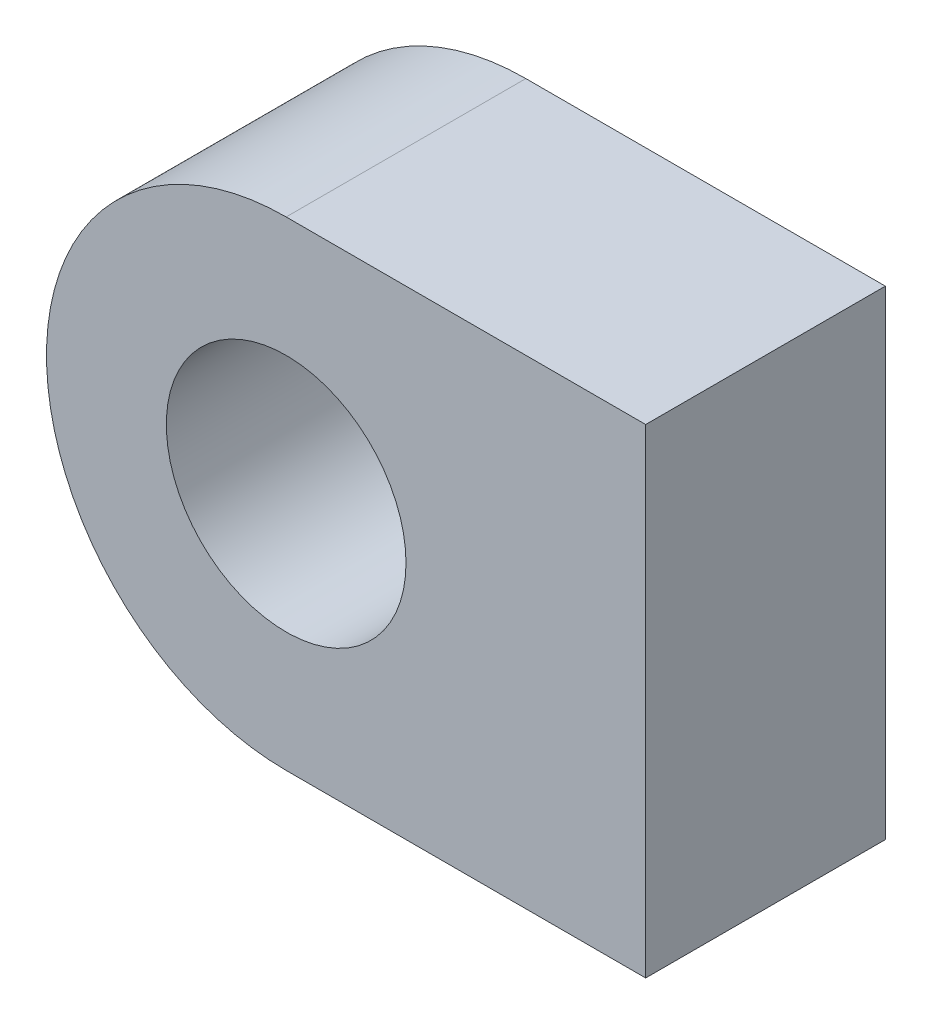
ISO-10303-21;
HEADER;
FILE_DESCRIPTION(('STEP AP214'),'2;1');
FILE_NAME('part.step','',(''),(''),'','','');
FILE_SCHEMA(('AUTOMOTIVE_DESIGN { 1 0 10303 214 1 1 1 1 }'));
ENDSEC;
DATA;
#1=APPLICATION_CONTEXT('core data for automotive mechanical design processes');
#2=APPLICATION_PROTOCOL_DEFINITION('international standard','automotive_design',2000,#1);
#3=PRODUCT_CONTEXT('',#1,'mechanical');
#4=PRODUCT('Part','Part','',(#3));
#5=PRODUCT_RELATED_PRODUCT_CATEGORY('part','',(#4));
#6=PRODUCT_DEFINITION_FORMATION('','',#4);
#7=PRODUCT_DEFINITION_CONTEXT('part definition',#1,'design');
#8=PRODUCT_DEFINITION('design','',#6,#7);
#9=PRODUCT_DEFINITION_SHAPE('','',#8);
#10=(LENGTH_UNIT() NAMED_UNIT(*) SI_UNIT(.MILLI.,.METRE.));
#11=(NAMED_UNIT(*) PLANE_ANGLE_UNIT() SI_UNIT($,.RADIAN.));
#12=(NAMED_UNIT(*) SI_UNIT($,.STERADIAN.) SOLID_ANGLE_UNIT());
#13=UNCERTAINTY_MEASURE_WITH_UNIT(LENGTH_MEASURE(1.E-05),#10,'distance_accuracy_value','');
#14=(GEOMETRIC_REPRESENTATION_CONTEXT(3) GLOBAL_UNCERTAINTY_ASSIGNED_CONTEXT((#13)) GLOBAL_UNIT_ASSIGNED_CONTEXT((#10,
#11,#12)) REPRESENTATION_CONTEXT('',''));
#15=CARTESIAN_POINT('',(0.,0.,0.));
#16=DIRECTION('',(0.,0.,1.));
#17=DIRECTION('',(1.,0.,0.));
#18=AXIS2_PLACEMENT_3D('',#15,#16,#17);
#19=CARTESIAN_POINT('',(0.,10.,-10.));
#20=DIRECTION('',(0.,1.,0.));
#21=DIRECTION('',(-1.,0.,0.));
#22=AXIS2_PLACEMENT_3D('',#19,#20,#21);
#23=PLANE('',#22);
#24=DIRECTION('',(-1.,0.,0.));
#25=VECTOR('',#24,1.);
#26=CARTESIAN_POINT('',(0.,10.,0.));
#27=LINE('',#26,#25);
#28=CARTESIAN_POINT('',(0.,10.,0.));
#29=VERTEX_POINT('',#28);
#30=CARTESIAN_POINT('',(-15.,10.,0.));
#31=VERTEX_POINT('',#30);
#32=EDGE_CURVE('E110',#29,#31,#27,.T.);
#33=ORIENTED_EDGE('',*,*,#32,.F.);
#34=DIRECTION('',(0.,0.,1.));
#35=VECTOR('',#34,1.);
#36=CARTESIAN_POINT('',(0.,10.,-10.));
#37=LINE('',#36,#35);
#38=CARTESIAN_POINT('',(0.,10.,-10.));
#39=VERTEX_POINT('',#38);
#40=EDGE_CURVE('E11',#39,#29,#37,.T.);
#41=ORIENTED_EDGE('',*,*,#40,.F.);
#42=DIRECTION('',(-1.,0.,0.));
#43=VECTOR('',#42,1.);
#44=CARTESIAN_POINT('',(0.,10.,-10.));
#45=LINE('',#44,#43);
#46=CARTESIAN_POINT('',(-15.,10.,-10.));
#47=VERTEX_POINT('',#46);
#48=EDGE_CURVE('E101',#39,#47,#45,.T.);
#49=ORIENTED_EDGE('',*,*,#48,.T.);
#50=DIRECTION('',(0.,0.,1.));
#51=VECTOR('',#50,1.);
#52=CARTESIAN_POINT('',(-15.,10.,-10.));
#53=LINE('',#52,#51);
#54=EDGE_CURVE('E42',#47,#31,#53,.T.);
#55=ORIENTED_EDGE('',*,*,#54,.T.);
#56=EDGE_LOOP('',(#33,#41,#49,#55));
#57=FACE_BOUND('',#56,.T.);
#58=ADVANCED_FACE('F39',(#57),#23,.T.);
#59=CARTESIAN_POINT('',(0.,10.,-10.));
#60=DIRECTION('',(1.,0.,0.));
#61=DIRECTION('',(0.,1.,0.));
#62=AXIS2_PLACEMENT_3D('',#59,#60,#61);
#63=PLANE('',#62);
#64=DIRECTION('',(0.,1.,0.));
#65=VECTOR('',#64,1.);
#66=CARTESIAN_POINT('',(0.,10.,0.));
#67=LINE('',#66,#65);
#68=CARTESIAN_POINT('',(0.,-9.99999999999999,0.));
#69=VERTEX_POINT('',#68);
#70=EDGE_CURVE('E104',#69,#29,#67,.T.);
#71=ORIENTED_EDGE('',*,*,#70,.F.);
#72=DIRECTION('',(0.,0.,1.));
#73=VECTOR('',#72,1.);
#74=CARTESIAN_POINT('',(0.,-9.99999999999999,-10.));
#75=LINE('',#74,#73);
#76=CARTESIAN_POINT('',(0.,-9.99999999999999,-10.));
#77=VERTEX_POINT('',#76);
#78=EDGE_CURVE('E49',#77,#69,#75,.T.);
#79=ORIENTED_EDGE('',*,*,#78,.F.);
#80=DIRECTION('',(0.,1.,0.));
#81=VECTOR('',#80,1.);
#82=CARTESIAN_POINT('',(0.,10.,-10.));
#83=LINE('',#82,#81);
#84=EDGE_CURVE('E96',#77,#39,#83,.T.);
#85=ORIENTED_EDGE('',*,*,#84,.T.);
#86=ORIENTED_EDGE('',*,*,#40,.T.);
#87=EDGE_LOOP('',(#71,#79,#85,#86));
#88=FACE_BOUND('',#87,.T.);
#89=ADVANCED_FACE('F127',(#88),#63,.T.);
#90=CARTESIAN_POINT('',(-15.,-9.99999999999999,-10.));
#91=DIRECTION('',(0.,-1.,0.));
#92=DIRECTION('',(1.,0.,0.));
#93=AXIS2_PLACEMENT_3D('',#90,#91,#92);
#94=PLANE('',#93);
#95=DIRECTION('',(1.,0.,0.));
#96=VECTOR('',#95,1.);
#97=CARTESIAN_POINT('',(-15.,-9.99999999999999,0.));
#98=LINE('',#97,#96);
#99=CARTESIAN_POINT('',(-15.,-9.99999999999999,0.));
#100=VERTEX_POINT('',#99);
#101=EDGE_CURVE('E90',#100,#69,#98,.T.);
#102=ORIENTED_EDGE('',*,*,#101,.F.);
#103=DIRECTION('',(0.,0.,1.));
#104=VECTOR('',#103,1.);
#105=CARTESIAN_POINT('',(-15.,-9.99999999999999,-10.));
#106=LINE('',#105,#104);
#107=CARTESIAN_POINT('',(-15.,-9.99999999999999,-10.));
#108=VERTEX_POINT('',#107);
#109=EDGE_CURVE('E85',#108,#100,#106,.T.);
#110=ORIENTED_EDGE('',*,*,#109,.F.);
#111=DIRECTION('',(1.,0.,0.));
#112=VECTOR('',#111,1.);
#113=CARTESIAN_POINT('',(-15.,-9.99999999999999,-10.));
#114=LINE('',#113,#112);
#115=EDGE_CURVE('E88',#108,#77,#114,.T.);
#116=ORIENTED_EDGE('',*,*,#115,.T.);
#117=ORIENTED_EDGE('',*,*,#78,.T.);
#118=EDGE_LOOP('',(#102,#110,#116,#117));
#119=FACE_BOUND('',#118,.T.);
#120=ADVANCED_FACE('F87',(#119),#94,.T.);
#121=CARTESIAN_POINT('',(-15.,0.,-10.));
#122=DIRECTION('',(0.,0.,1.));
#123=DIRECTION('',(1.,0.,0.));
#124=AXIS2_PLACEMENT_3D('',#121,#122,#123);
#125=CYLINDRICAL_SURFACE('',#124,10.);
#126=CARTESIAN_POINT('',(-15.,0.,0.));
#127=DIRECTION('',(0.,0.,1.));
#128=DIRECTION('',(1.,0.,0.));
#129=AXIS2_PLACEMENT_3D('',#126,#127,#128);
#130=CIRCLE('',#129,10.);
#131=EDGE_CURVE('E114',#31,#100,#130,.T.);
#132=ORIENTED_EDGE('',*,*,#131,.F.);
#133=ORIENTED_EDGE('',*,*,#54,.F.);
#134=CARTESIAN_POINT('',(-15.,0.,-10.));
#135=DIRECTION('',(0.,0.,1.));
#136=DIRECTION('',(1.,0.,0.));
#137=AXIS2_PLACEMENT_3D('',#134,#135,#136);
#138=CIRCLE('',#137,10.);
#139=EDGE_CURVE('E95',#47,#108,#138,.T.);
#140=ORIENTED_EDGE('',*,*,#139,.T.);
#141=ORIENTED_EDGE('',*,*,#109,.T.);
#142=EDGE_LOOP('',(#132,#133,#140,#141));
#143=FACE_BOUND('',#142,.T.);
#144=ADVANCED_FACE('F99',(#143),#125,.T.);
#145=CARTESIAN_POINT('',(-15.,0.,-10.));
#146=DIRECTION('',(0.,0.,1.));
#147=DIRECTION('',(1.,0.,0.));
#148=AXIS2_PLACEMENT_3D('',#145,#146,#147);
#149=PLANE('',#148);
#150=CARTESIAN_POINT('',(-15.,0.,-10.));
#151=DIRECTION('',(0.,0.,1.));
#152=DIRECTION('',(1.,0.,0.));
#153=AXIS2_PLACEMENT_3D('',#150,#151,#152);
#154=CIRCLE('',#153,5.);
#155=CARTESIAN_POINT('',(-10.,0.,-10.));
#156=VERTEX_POINT('',#155);
#157=EDGE_CURVE('E115',#156,#156,#154,.T.);
#158=ORIENTED_EDGE('',*,*,#157,.T.);
#159=EDGE_LOOP('',(#158));
#160=FACE_BOUND('',#159,.T.);
#161=ORIENTED_EDGE('',*,*,#48,.F.);
#162=ORIENTED_EDGE('',*,*,#84,.F.);
#163=ORIENTED_EDGE('',*,*,#115,.F.);
#164=ORIENTED_EDGE('',*,*,#139,.F.);
#165=EDGE_LOOP('',(#161,#162,#163,#164));
#166=FACE_BOUND('',#165,.T.);
#167=ADVANCED_FACE('F94',(#160,#166),#149,.F.);
#168=CARTESIAN_POINT('',(-15.,0.,0.));
#169=DIRECTION('',(0.,0.,1.));
#170=DIRECTION('',(1.,0.,0.));
#171=AXIS2_PLACEMENT_3D('',#168,#169,#170);
#172=PLANE('',#171);
#173=CARTESIAN_POINT('',(-15.,0.,0.));
#174=DIRECTION('',(0.,0.,1.));
#175=DIRECTION('',(1.,0.,0.));
#176=AXIS2_PLACEMENT_3D('',#173,#174,#175);
#177=CIRCLE('',#176,5.);
#178=CARTESIAN_POINT('',(-10.,0.,0.));
#179=VERTEX_POINT('',#178);
#180=EDGE_CURVE('E157',#179,#179,#177,.T.);
#181=ORIENTED_EDGE('',*,*,#180,.F.);
#182=EDGE_LOOP('',(#181));
#183=FACE_BOUND('',#182,.T.);
#184=ORIENTED_EDGE('',*,*,#32,.T.);
#185=ORIENTED_EDGE('',*,*,#131,.T.);
#186=ORIENTED_EDGE('',*,*,#101,.T.);
#187=ORIENTED_EDGE('',*,*,#70,.T.);
#188=EDGE_LOOP('',(#184,#185,#186,#187));
#189=FACE_BOUND('',#188,.T.);
#190=ADVANCED_FACE('F126',(#183,#189),#172,.T.);
#191=CARTESIAN_POINT('',(-15.,0.,-10.));
#192=DIRECTION('',(0.,0.,1.));
#193=DIRECTION('',(1.,0.,0.));
#194=AXIS2_PLACEMENT_3D('',#191,#192,#193);
#195=CYLINDRICAL_SURFACE('',#194,5.);
#196=ORIENTED_EDGE('',*,*,#157,.F.);
#197=EDGE_LOOP('',(#196));
#198=FACE_BOUND('',#197,.T.);
#199=ORIENTED_EDGE('',*,*,#180,.T.);
#200=EDGE_LOOP('',(#199));
#201=FACE_BOUND('',#200,.T.);
#202=ADVANCED_FACE('F145',(#198,#201),#195,.F.);
#203=CLOSED_SHELL('',(#58,#89,#120,#144,#167,#190,#202));
#204=MANIFOLD_SOLID_BREP('B2',#203);
#205=ADVANCED_BREP_SHAPE_REPRESENTATION('',(#18,#204),#14);
#206=SHAPE_DEFINITION_REPRESENTATION(#9,#205);
ENDSEC;
END-ISO-10303-21;
